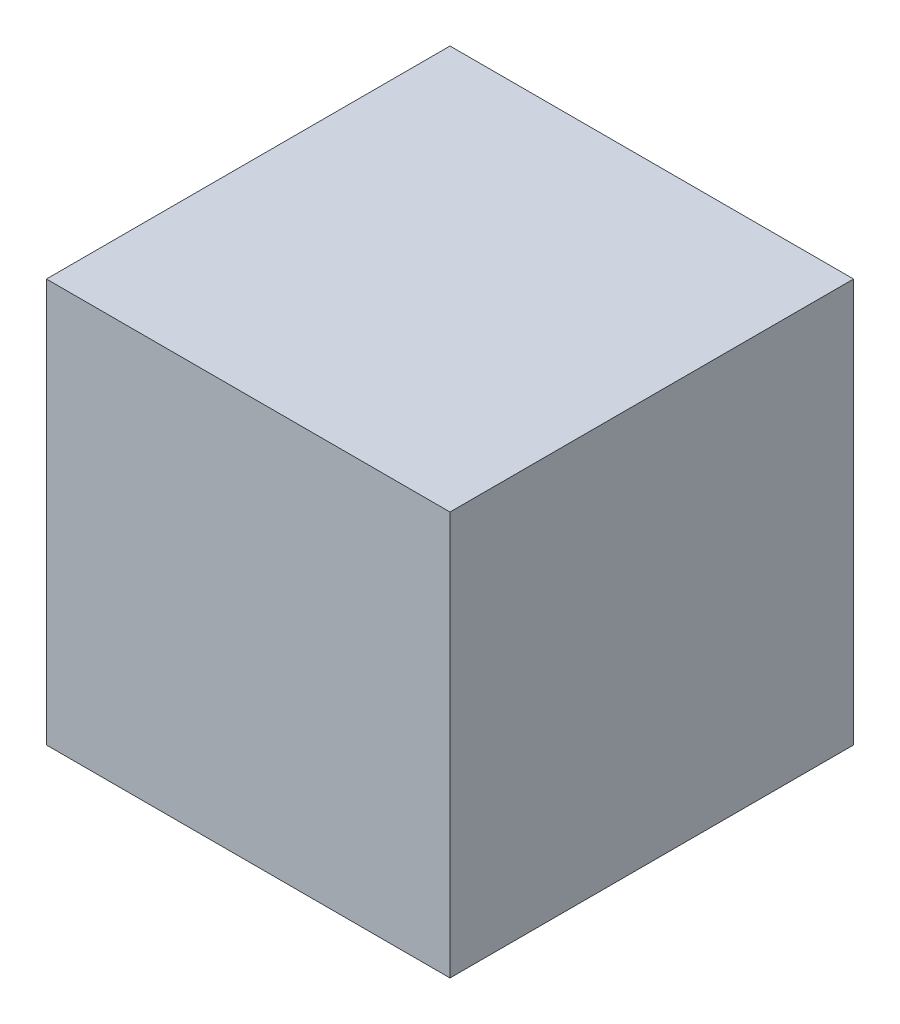
ISO-10303-21;
HEADER;
FILE_DESCRIPTION(('STEP AP214'),'2;1');
FILE_NAME('part.step','',(''),(''),'','','');
FILE_SCHEMA(('AUTOMOTIVE_DESIGN { 1 0 10303 214 1 1 1 1 }'));
ENDSEC;
DATA;
#1=APPLICATION_CONTEXT('core data for automotive mechanical design processes');
#2=APPLICATION_PROTOCOL_DEFINITION('international standard','automotive_design',2000,#1);
#3=PRODUCT_CONTEXT('',#1,'mechanical');
#4=PRODUCT('Part','Part','',(#3));
#5=PRODUCT_RELATED_PRODUCT_CATEGORY('part','',(#4));
#6=PRODUCT_DEFINITION_FORMATION('','',#4);
#7=PRODUCT_DEFINITION_CONTEXT('part definition',#1,'design');
#8=PRODUCT_DEFINITION('design','',#6,#7);
#9=PRODUCT_DEFINITION_SHAPE('','',#8);
#10=(LENGTH_UNIT() NAMED_UNIT(*) SI_UNIT(.MILLI.,.METRE.));
#11=(NAMED_UNIT(*) PLANE_ANGLE_UNIT() SI_UNIT($,.RADIAN.));
#12=(NAMED_UNIT(*) SI_UNIT($,.STERADIAN.) SOLID_ANGLE_UNIT());
#13=UNCERTAINTY_MEASURE_WITH_UNIT(LENGTH_MEASURE(1.E-05),#10,'distance_accuracy_value','');
#14=(GEOMETRIC_REPRESENTATION_CONTEXT(3) GLOBAL_UNCERTAINTY_ASSIGNED_CONTEXT((#13)) GLOBAL_UNIT_ASSIGNED_CONTEXT((#10,
#11,#12)) REPRESENTATION_CONTEXT('',''));
#15=CARTESIAN_POINT('',(0.,0.,0.));
#16=DIRECTION('',(0.,0.,1.));
#17=DIRECTION('',(1.,0.,0.));
#18=AXIS2_PLACEMENT_3D('',#15,#16,#17);
#19=CARTESIAN_POINT('',(-15.,-15.,15.));
#20=DIRECTION('',(-1.,0.,0.));
#21=DIRECTION('',(0.,0.,1.));
#22=AXIS2_PLACEMENT_3D('',#19,#20,#21);
#23=PLANE('',#22);
#24=DIRECTION('',(0.,1.,0.));
#25=VECTOR('',#24,1.);
#26=CARTESIAN_POINT('',(-15.,-15.,15.));
#27=LINE('',#26,#25);
#28=CARTESIAN_POINT('',(-15.,-15.,15.));
#29=VERTEX_POINT('',#28);
#30=CARTESIAN_POINT('',(-15.,15.,15.));
#31=VERTEX_POINT('',#30);
#32=EDGE_CURVE('E46',#29,#31,#27,.T.);
#33=ORIENTED_EDGE('',*,*,#32,.T.);
#34=DIRECTION('',(0.,0.,1.));
#35=VECTOR('',#34,1.);
#36=CARTESIAN_POINT('',(-15.,15.,15.));
#37=LINE('',#36,#35);
#38=CARTESIAN_POINT('',(-15.,15.,-15.));
#39=VERTEX_POINT('',#38);
#40=EDGE_CURVE('E84',#39,#31,#37,.T.);
#41=ORIENTED_EDGE('',*,*,#40,.F.);
#42=DIRECTION('',(0.,1.,0.));
#43=VECTOR('',#42,1.);
#44=CARTESIAN_POINT('',(-15.,-15.,-15.));
#45=LINE('',#44,#43);
#46=CARTESIAN_POINT('',(-15.,-15.,-15.));
#47=VERTEX_POINT('',#46);
#48=EDGE_CURVE('E11',#47,#39,#45,.T.);
#49=ORIENTED_EDGE('',*,*,#48,.F.);
#50=DIRECTION('',(0.,0.,1.));
#51=VECTOR('',#50,1.);
#52=CARTESIAN_POINT('',(-15.,-15.,15.));
#53=LINE('',#52,#51);
#54=EDGE_CURVE('E85',#47,#29,#53,.T.);
#55=ORIENTED_EDGE('',*,*,#54,.T.);
#56=EDGE_LOOP('',(#33,#41,#49,#55));
#57=FACE_BOUND('',#56,.T.);
#58=ADVANCED_FACE('F43',(#57),#23,.T.);
#59=CARTESIAN_POINT('',(15.,-15.,-15.));
#60=DIRECTION('',(0.,0.,-1.));
#61=DIRECTION('',(-1.,0.,0.));
#62=AXIS2_PLACEMENT_3D('',#59,#60,#61);
#63=PLANE('',#62);
#64=ORIENTED_EDGE('',*,*,#48,.T.);
#65=DIRECTION('',(-1.,0.,0.));
#66=VECTOR('',#65,1.);
#67=CARTESIAN_POINT('',(15.,15.,-15.));
#68=LINE('',#67,#66);
#69=CARTESIAN_POINT('',(15.,15.,-15.));
#70=VERTEX_POINT('',#69);
#71=EDGE_CURVE('E103',#70,#39,#68,.T.);
#72=ORIENTED_EDGE('',*,*,#71,.F.);
#73=DIRECTION('',(0.,1.,0.));
#74=VECTOR('',#73,1.);
#75=CARTESIAN_POINT('',(15.,-15.,-15.));
#76=LINE('',#75,#74);
#77=CARTESIAN_POINT('',(15.,-15.,-15.));
#78=VERTEX_POINT('',#77);
#79=EDGE_CURVE('E52',#78,#70,#76,.T.);
#80=ORIENTED_EDGE('',*,*,#79,.F.);
#81=DIRECTION('',(-1.,0.,0.));
#82=VECTOR('',#81,1.);
#83=CARTESIAN_POINT('',(15.,-15.,-15.));
#84=LINE('',#83,#82);
#85=EDGE_CURVE('E91',#78,#47,#84,.T.);
#86=ORIENTED_EDGE('',*,*,#85,.T.);
#87=EDGE_LOOP('',(#64,#72,#80,#86));
#88=FACE_BOUND('',#87,.T.);
#89=ADVANCED_FACE('F127',(#88),#63,.T.);
#90=CARTESIAN_POINT('',(15.,-15.,15.));
#91=DIRECTION('',(1.,0.,0.));
#92=DIRECTION('',(0.,0.,-1.));
#93=AXIS2_PLACEMENT_3D('',#90,#91,#92);
#94=PLANE('',#93);
#95=ORIENTED_EDGE('',*,*,#79,.T.);
#96=DIRECTION('',(0.,0.,-1.));
#97=VECTOR('',#96,1.);
#98=CARTESIAN_POINT('',(15.,15.,15.));
#99=LINE('',#98,#97);
#100=CARTESIAN_POINT('',(15.,15.,15.));
#101=VERTEX_POINT('',#100);
#102=EDGE_CURVE('E99',#101,#70,#99,.T.);
#103=ORIENTED_EDGE('',*,*,#102,.F.);
#104=DIRECTION('',(0.,1.,0.));
#105=VECTOR('',#104,1.);
#106=CARTESIAN_POINT('',(15.,-15.,15.));
#107=LINE('',#106,#105);
#108=CARTESIAN_POINT('',(15.,-15.,15.));
#109=VERTEX_POINT('',#108);
#110=EDGE_CURVE('E90',#109,#101,#107,.T.);
#111=ORIENTED_EDGE('',*,*,#110,.F.);
#112=DIRECTION('',(0.,0.,-1.));
#113=VECTOR('',#112,1.);
#114=CARTESIAN_POINT('',(15.,-15.,15.));
#115=LINE('',#114,#113);
#116=EDGE_CURVE('E116',#109,#78,#115,.T.);
#117=ORIENTED_EDGE('',*,*,#116,.T.);
#118=EDGE_LOOP('',(#95,#103,#111,#117));
#119=FACE_BOUND('',#118,.T.);
#120=ADVANCED_FACE('F124',(#119),#94,.T.);
#121=CARTESIAN_POINT('',(15.,-15.,15.));
#122=DIRECTION('',(0.,0.,1.));
#123=DIRECTION('',(1.,0.,0.));
#124=AXIS2_PLACEMENT_3D('',#121,#122,#123);
#125=PLANE('',#124);
#126=ORIENTED_EDGE('',*,*,#110,.T.);
#127=DIRECTION('',(1.,0.,0.));
#128=VECTOR('',#127,1.);
#129=CARTESIAN_POINT('',(15.,15.,15.));
#130=LINE('',#129,#128);
#131=EDGE_CURVE('E93',#31,#101,#130,.T.);
#132=ORIENTED_EDGE('',*,*,#131,.F.);
#133=ORIENTED_EDGE('',*,*,#32,.F.);
#134=DIRECTION('',(1.,0.,0.));
#135=VECTOR('',#134,1.);
#136=CARTESIAN_POINT('',(15.,-15.,15.));
#137=LINE('',#136,#135);
#138=EDGE_CURVE('E113',#29,#109,#137,.T.);
#139=ORIENTED_EDGE('',*,*,#138,.T.);
#140=EDGE_LOOP('',(#126,#132,#133,#139));
#141=FACE_BOUND('',#140,.T.);
#142=ADVANCED_FACE('F94',(#141),#125,.T.);
#143=CARTESIAN_POINT('',(0.,-15.,0.));
#144=DIRECTION('',(0.,1.,0.));
#145=DIRECTION('',(0.,0.,1.));
#146=AXIS2_PLACEMENT_3D('',#143,#144,#145);
#147=PLANE('',#146);
#148=ORIENTED_EDGE('',*,*,#54,.F.);
#149=ORIENTED_EDGE('',*,*,#85,.F.);
#150=ORIENTED_EDGE('',*,*,#116,.F.);
#151=ORIENTED_EDGE('',*,*,#138,.F.);
#152=EDGE_LOOP('',(#148,#149,#150,#151));
#153=FACE_BOUND('',#152,.T.);
#154=ADVANCED_FACE('F129',(#153),#147,.F.);
#155=CARTESIAN_POINT('',(0.,15.,0.));
#156=DIRECTION('',(0.,1.,0.));
#157=DIRECTION('',(0.,0.,1.));
#158=AXIS2_PLACEMENT_3D('',#155,#156,#157);
#159=PLANE('',#158);
#160=ORIENTED_EDGE('',*,*,#40,.T.);
#161=ORIENTED_EDGE('',*,*,#131,.T.);
#162=ORIENTED_EDGE('',*,*,#102,.T.);
#163=ORIENTED_EDGE('',*,*,#71,.T.);
#164=EDGE_LOOP('',(#160,#161,#162,#163));
#165=FACE_BOUND('',#164,.T.);
#166=ADVANCED_FACE('F102',(#165),#159,.T.);
#167=CLOSED_SHELL('',(#58,#89,#120,#142,#154,#166));
#168=MANIFOLD_SOLID_BREP('B2',#167);
#169=ADVANCED_BREP_SHAPE_REPRESENTATION('',(#18,#168),#14);
#170=SHAPE_DEFINITION_REPRESENTATION(#9,#169);
ENDSEC;
END-ISO-10303-21;
